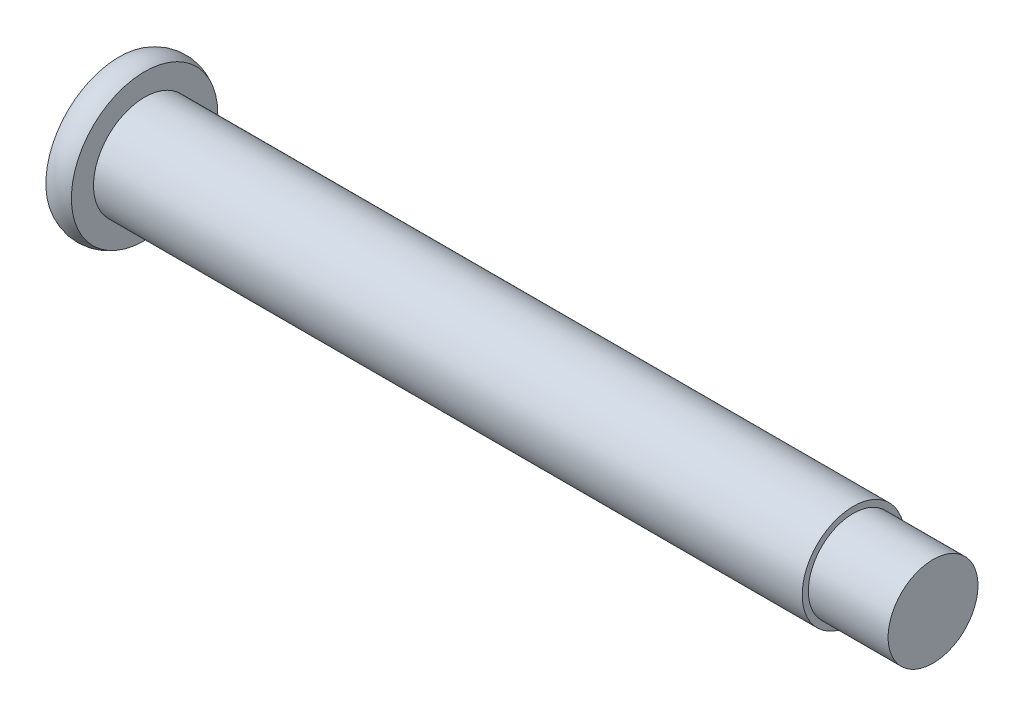
ISO-10303-21;
HEADER;
FILE_DESCRIPTION(('STEP AP214'),'2;1');
FILE_NAME('part.step','',(''),(''),'','','');
FILE_SCHEMA(('AUTOMOTIVE_DESIGN { 1 0 10303 214 1 1 1 1 }'));
ENDSEC;
DATA;
#1=APPLICATION_CONTEXT('core data for automotive mechanical design processes');
#2=APPLICATION_PROTOCOL_DEFINITION('international standard','automotive_design',2000,#1);
#3=PRODUCT_CONTEXT('',#1,'mechanical');
#4=PRODUCT('Part','Part','',(#3));
#5=PRODUCT_RELATED_PRODUCT_CATEGORY('part','',(#4));
#6=PRODUCT_DEFINITION_FORMATION('','',#4);
#7=PRODUCT_DEFINITION_CONTEXT('part definition',#1,'design');
#8=PRODUCT_DEFINITION('design','',#6,#7);
#9=PRODUCT_DEFINITION_SHAPE('','',#8);
#10=(LENGTH_UNIT() NAMED_UNIT(*) SI_UNIT(.MILLI.,.METRE.));
#11=(NAMED_UNIT(*) PLANE_ANGLE_UNIT() SI_UNIT($,.RADIAN.));
#12=(NAMED_UNIT(*) SI_UNIT($,.STERADIAN.) SOLID_ANGLE_UNIT());
#13=UNCERTAINTY_MEASURE_WITH_UNIT(LENGTH_MEASURE(1.E-05),#10,'distance_accuracy_value','');
#14=(GEOMETRIC_REPRESENTATION_CONTEXT(3) GLOBAL_UNCERTAINTY_ASSIGNED_CONTEXT((#13)) GLOBAL_UNIT_ASSIGNED_CONTEXT((#10,
#11,#12)) REPRESENTATION_CONTEXT('',''));
#15=CARTESIAN_POINT('',(0.,0.,0.));
#16=DIRECTION('',(0.,0.,1.));
#17=DIRECTION('',(1.,0.,0.));
#18=AXIS2_PLACEMENT_3D('',#15,#16,#17);
#19=CARTESIAN_POINT('',(101.20122,2.794,0.));
#20=DIRECTION('',(1.,0.,0.));
#21=DIRECTION('',(0.,0.,-1.));
#22=AXIS2_PLACEMENT_3D('',#19,#20,#21);
#23=PLANE('',#22);
#24=CARTESIAN_POINT('',(101.20122,0.,0.));
#25=DIRECTION('',(1.,0.,0.));
#26=DIRECTION('',(0.,0.,-1.));
#27=AXIS2_PLACEMENT_3D('',#24,#25,#26);
#28=CIRCLE('',#27,5.58800000000003);
#29=CARTESIAN_POINT('',(101.20122,0.,-5.58800000000003));
#30=VERTEX_POINT('',#29);
#31=EDGE_CURVE('E18',#30,#30,#28,.F.);
#32=ORIENTED_EDGE('',*,*,#31,.F.);
#33=EDGE_LOOP('',(#32));
#34=FACE_BOUND('',#33,.T.);
#35=ADVANCED_FACE('F15',(#34),#23,.T.);
#36=CARTESIAN_POINT('',(0.,4.54981532850779,0.));
#37=DIRECTION('',(-1.,0.,0.));
#38=DIRECTION('',(0.,0.,1.));
#39=AXIS2_PLACEMENT_3D('',#36,#37,#38);
#40=PLANE('',#39);
#41=CARTESIAN_POINT('',(0.,0.,0.));
#42=DIRECTION('',(1.,0.,0.));
#43=DIRECTION('',(0.,0.,-1.));
#44=AXIS2_PLACEMENT_3D('',#41,#42,#43);
#45=CIRCLE('',#44,9.09963065701555);
#46=CARTESIAN_POINT('',(0.,0.,-9.09963065701555));
#47=VERTEX_POINT('',#46);
#48=EDGE_CURVE('E36',#47,#47,#45,.T.);
#49=ORIENTED_EDGE('',*,*,#48,.F.);
#50=EDGE_LOOP('',(#49));
#51=FACE_BOUND('',#50,.T.);
#52=ADVANCED_FACE('F46',(#51),#40,.T.);
#53=CARTESIAN_POINT('',(96.2402825000001,0.,0.));
#54=DIRECTION('',(1.,0.,0.));
#55=DIRECTION('',(0.,0.,-1.));
#56=AXIS2_PLACEMENT_3D('',#53,#54,#55);
#57=CYLINDRICAL_SURFACE('',#56,5.58800000000003);
#58=CARTESIAN_POINT('',(91.279345,0.,0.));
#59=DIRECTION('',(1.,0.,0.));
#60=DIRECTION('',(0.,0.,-1.));
#61=AXIS2_PLACEMENT_3D('',#58,#59,#60);
#62=CIRCLE('',#61,5.58800000000003);
#63=CARTESIAN_POINT('',(91.279345,0.,-5.58800000000003));
#64=VERTEX_POINT('',#63);
#65=EDGE_CURVE('E34',#64,#64,#62,.F.);
#66=ORIENTED_EDGE('',*,*,#65,.F.);
#67=EDGE_LOOP('',(#66));
#68=FACE_BOUND('',#67,.T.);
#69=ORIENTED_EDGE('',*,*,#31,.T.);
#70=EDGE_LOOP('',(#69));
#71=FACE_BOUND('',#70,.T.);
#72=ADVANCED_FACE('F43',(#68,#71),#57,.T.);
#73=CARTESIAN_POINT('',(1.58750000000005,0.,0.));
#74=DIRECTION('',(1.,0.,0.));
#75=DIRECTION('',(0.,0.,-1.));
#76=AXIS2_PLACEMENT_3D('',#73,#74,#75);
#77=TOROIDAL_SURFACE('',#76,6.34999999999998,3.175);
#78=ORIENTED_EDGE('',*,*,#48,.T.);
#79=EDGE_LOOP('',(#78));
#80=FACE_BOUND('',#79,.T.);
#81=CARTESIAN_POINT('',(3.17500000000005,0.,0.));
#82=DIRECTION('',(1.,0.,0.));
#83=DIRECTION('',(0.,0.,-1.));
#84=AXIS2_PLACEMENT_3D('',#81,#82,#83);
#85=CIRCLE('',#84,9.09963065701557);
#86=CARTESIAN_POINT('',(3.17500000000005,0.,-9.09963065701557));
#87=VERTEX_POINT('',#86);
#88=EDGE_CURVE('E27',#87,#87,#85,.T.);
#89=ORIENTED_EDGE('',*,*,#88,.F.);
#90=EDGE_LOOP('',(#89));
#91=FACE_BOUND('',#90,.T.);
#92=ADVANCED_FACE('F66',(#80,#91),#77,.T.);
#93=CARTESIAN_POINT('',(91.279345,5.969,0.));
#94=DIRECTION('',(1.,0.,0.));
#95=DIRECTION('',(0.,0.,-1.));
#96=AXIS2_PLACEMENT_3D('',#93,#94,#95);
#97=PLANE('',#96);
#98=ORIENTED_EDGE('',*,*,#65,.T.);
#99=EDGE_LOOP('',(#98));
#100=FACE_BOUND('',#99,.T.);
#101=CARTESIAN_POINT('',(91.279345,0.,0.));
#102=DIRECTION('',(1.,0.,0.));
#103=DIRECTION('',(0.,0.,-1.));
#104=AXIS2_PLACEMENT_3D('',#101,#102,#103);
#105=CIRCLE('',#104,6.35);
#106=CARTESIAN_POINT('',(91.279345,0.,-6.35));
#107=VERTEX_POINT('',#106);
#108=EDGE_CURVE('E22',#107,#107,#105,.F.);
#109=ORIENTED_EDGE('',*,*,#108,.F.);
#110=EDGE_LOOP('',(#109));
#111=FACE_BOUND('',#110,.T.);
#112=ADVANCED_FACE('F59',(#100,#111),#97,.T.);
#113=CARTESIAN_POINT('',(3.17500000000005,3.175,0.));
#114=DIRECTION('',(1.,0.,0.));
#115=DIRECTION('',(0.,0.,-1.));
#116=AXIS2_PLACEMENT_3D('',#113,#114,#115);
#117=PLANE('',#116);
#118=CARTESIAN_POINT('',(3.17500000000005,0.,0.));
#119=DIRECTION('',(1.,0.,0.));
#120=DIRECTION('',(0.,0.,-1.));
#121=AXIS2_PLACEMENT_3D('',#118,#119,#120);
#122=CIRCLE('',#121,6.35);
#123=CARTESIAN_POINT('',(3.17500000000005,0.,-6.35));
#124=VERTEX_POINT('',#123);
#125=EDGE_CURVE('E10',#124,#124,#122,.T.);
#126=ORIENTED_EDGE('',*,*,#125,.F.);
#127=EDGE_LOOP('',(#126));
#128=FACE_BOUND('',#127,.T.);
#129=ORIENTED_EDGE('',*,*,#88,.T.);
#130=EDGE_LOOP('',(#129));
#131=FACE_BOUND('',#130,.T.);
#132=ADVANCED_FACE('F54',(#128,#131),#117,.T.);
#133=CARTESIAN_POINT('',(47.2271725,0.,0.));
#134=DIRECTION('',(1.,0.,0.));
#135=DIRECTION('',(0.,0.,-1.));
#136=AXIS2_PLACEMENT_3D('',#133,#134,#135);
#137=CYLINDRICAL_SURFACE('',#136,6.35);
#138=ORIENTED_EDGE('',*,*,#125,.T.);
#139=EDGE_LOOP('',(#138));
#140=FACE_BOUND('',#139,.T.);
#141=ORIENTED_EDGE('',*,*,#108,.T.);
#142=EDGE_LOOP('',(#141));
#143=FACE_BOUND('',#142,.T.);
#144=ADVANCED_FACE('F52',(#140,#143),#137,.T.);
#145=CLOSED_SHELL('',(#35,#52,#72,#92,#112,#132,#144));
#146=MANIFOLD_SOLID_BREP('B1',#145);
#147=ADVANCED_BREP_SHAPE_REPRESENTATION('',(#18,#146),#14);
#148=SHAPE_DEFINITION_REPRESENTATION(#9,#147);
ENDSEC;
END-ISO-10303-21;
